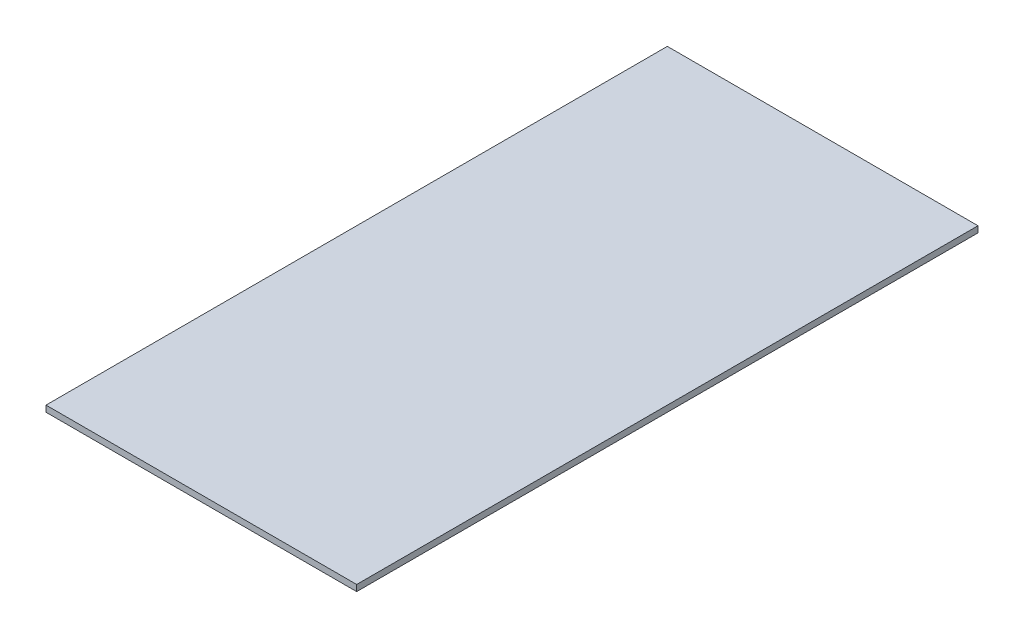
ISO-10303-21;
HEADER;
FILE_DESCRIPTION(('STEP AP214'),'2;1');
FILE_NAME('part.step','',(''),(''),'','','');
FILE_SCHEMA(('AUTOMOTIVE_DESIGN { 1 0 10303 214 1 1 1 1 }'));
ENDSEC;
DATA;
#1=APPLICATION_CONTEXT('core data for automotive mechanical design processes');
#2=APPLICATION_PROTOCOL_DEFINITION('international standard','automotive_design',2000,#1);
#3=PRODUCT_CONTEXT('',#1,'mechanical');
#4=PRODUCT('Part','Part','',(#3));
#5=PRODUCT_RELATED_PRODUCT_CATEGORY('part','',(#4));
#6=PRODUCT_DEFINITION_FORMATION('','',#4);
#7=PRODUCT_DEFINITION_CONTEXT('part definition',#1,'design');
#8=PRODUCT_DEFINITION('design','',#6,#7);
#9=PRODUCT_DEFINITION_SHAPE('','',#8);
#10=(LENGTH_UNIT() NAMED_UNIT(*) SI_UNIT(.MILLI.,.METRE.));
#11=(NAMED_UNIT(*) PLANE_ANGLE_UNIT() SI_UNIT($,.RADIAN.));
#12=(NAMED_UNIT(*) SI_UNIT($,.STERADIAN.) SOLID_ANGLE_UNIT());
#13=UNCERTAINTY_MEASURE_WITH_UNIT(LENGTH_MEASURE(1.E-05),#10,'distance_accuracy_value','');
#14=(GEOMETRIC_REPRESENTATION_CONTEXT(3) GLOBAL_UNCERTAINTY_ASSIGNED_CONTEXT((#13)) GLOBAL_UNIT_ASSIGNED_CONTEXT((#10,
#11,#12)) REPRESENTATION_CONTEXT('',''));
#15=CARTESIAN_POINT('',(0.,0.,0.));
#16=DIRECTION('',(0.,0.,1.));
#17=DIRECTION('',(1.,0.,0.));
#18=AXIS2_PLACEMENT_3D('',#15,#16,#17);
#19=CARTESIAN_POINT('',(100.,4.,150.511260396948));
#20=DIRECTION('',(-1.,0.,0.));
#21=DIRECTION('',(0.,0.,1.));
#22=AXIS2_PLACEMENT_3D('',#19,#20,#21);
#23=PLANE('',#22);
#24=DIRECTION('',(0.,0.,-1.));
#25=VECTOR('',#24,1.);
#26=CARTESIAN_POINT('',(100.,0.,150.511260396948));
#27=LINE('',#26,#25);
#28=CARTESIAN_POINT('',(100.,0.,150.511260396948));
#29=VERTEX_POINT('',#28);
#30=CARTESIAN_POINT('',(100.,0.,-249.488739603052));
#31=VERTEX_POINT('',#30);
#32=EDGE_CURVE('E96',#29,#31,#27,.T.);
#33=ORIENTED_EDGE('',*,*,#32,.T.);
#34=DIRECTION('',(0.,-1.,0.));
#35=VECTOR('',#34,1.);
#36=CARTESIAN_POINT('',(100.,4.,-249.488739603052));
#37=LINE('',#36,#35);
#38=CARTESIAN_POINT('',(100.,4.,-249.488739603052));
#39=VERTEX_POINT('',#38);
#40=EDGE_CURVE('E11',#39,#31,#37,.T.);
#41=ORIENTED_EDGE('',*,*,#40,.F.);
#42=DIRECTION('',(0.,0.,-1.));
#43=VECTOR('',#42,1.);
#44=CARTESIAN_POINT('',(100.,4.,150.511260396948));
#45=LINE('',#44,#43);
#46=CARTESIAN_POINT('',(100.,4.,150.511260396948));
#47=VERTEX_POINT('',#46);
#48=EDGE_CURVE('E84',#47,#39,#45,.T.);
#49=ORIENTED_EDGE('',*,*,#48,.F.);
#50=DIRECTION('',(0.,-1.,0.));
#51=VECTOR('',#50,1.);
#52=CARTESIAN_POINT('',(100.,4.,150.511260396948));
#53=LINE('',#52,#51);
#54=EDGE_CURVE('E92',#47,#29,#53,.T.);
#55=ORIENTED_EDGE('',*,*,#54,.T.);
#56=EDGE_LOOP('',(#33,#41,#49,#55));
#57=FACE_BOUND('',#56,.T.);
#58=ADVANCED_FACE('F33',(#57),#23,.F.);
#59=CARTESIAN_POINT('',(-100.,4.,-249.488739603052));
#60=DIRECTION('',(0.,0.,1.));
#61=DIRECTION('',(1.,0.,0.));
#62=AXIS2_PLACEMENT_3D('',#59,#60,#61);
#63=PLANE('',#62);
#64=DIRECTION('',(-1.,0.,0.));
#65=VECTOR('',#64,1.);
#66=CARTESIAN_POINT('',(-100.,0.,-249.488739603052));
#67=LINE('',#66,#65);
#68=CARTESIAN_POINT('',(-100.,0.,-249.488739603052));
#69=VERTEX_POINT('',#68);
#70=EDGE_CURVE('E88',#31,#69,#67,.T.);
#71=ORIENTED_EDGE('',*,*,#70,.T.);
#72=DIRECTION('',(0.,-1.,0.));
#73=VECTOR('',#72,1.);
#74=CARTESIAN_POINT('',(-100.,4.,-249.488739603052));
#75=LINE('',#74,#73);
#76=CARTESIAN_POINT('',(-100.,4.,-249.488739603052));
#77=VERTEX_POINT('',#76);
#78=EDGE_CURVE('E41',#77,#69,#75,.T.);
#79=ORIENTED_EDGE('',*,*,#78,.F.);
#80=DIRECTION('',(-1.,0.,0.));
#81=VECTOR('',#80,1.);
#82=CARTESIAN_POINT('',(-100.,4.,-249.488739603052));
#83=LINE('',#82,#81);
#84=EDGE_CURVE('E79',#39,#77,#83,.T.);
#85=ORIENTED_EDGE('',*,*,#84,.F.);
#86=ORIENTED_EDGE('',*,*,#40,.T.);
#87=EDGE_LOOP('',(#71,#79,#85,#86));
#88=FACE_BOUND('',#87,.T.);
#89=ADVANCED_FACE('F87',(#88),#63,.F.);
#90=CARTESIAN_POINT('',(-100.,4.,150.511260396948));
#91=DIRECTION('',(1.,0.,0.));
#92=DIRECTION('',(0.,0.,-1.));
#93=AXIS2_PLACEMENT_3D('',#90,#91,#92);
#94=PLANE('',#93);
#95=DIRECTION('',(0.,0.,1.));
#96=VECTOR('',#95,1.);
#97=CARTESIAN_POINT('',(-100.,0.,150.511260396948));
#98=LINE('',#97,#96);
#99=CARTESIAN_POINT('',(-100.,0.,150.511260396948));
#100=VERTEX_POINT('',#99);
#101=EDGE_CURVE('E66',#69,#100,#98,.T.);
#102=ORIENTED_EDGE('',*,*,#101,.T.);
#103=DIRECTION('',(0.,-1.,0.));
#104=VECTOR('',#103,1.);
#105=CARTESIAN_POINT('',(-100.,4.,150.511260396948));
#106=LINE('',#105,#104);
#107=CARTESIAN_POINT('',(-100.,4.,150.511260396948));
#108=VERTEX_POINT('',#107);
#109=EDGE_CURVE('E89',#108,#100,#106,.T.);
#110=ORIENTED_EDGE('',*,*,#109,.F.);
#111=DIRECTION('',(0.,0.,1.));
#112=VECTOR('',#111,1.);
#113=CARTESIAN_POINT('',(-100.,4.,150.511260396948));
#114=LINE('',#113,#112);
#115=EDGE_CURVE('E82',#77,#108,#114,.T.);
#116=ORIENTED_EDGE('',*,*,#115,.F.);
#117=ORIENTED_EDGE('',*,*,#78,.T.);
#118=EDGE_LOOP('',(#102,#110,#116,#117));
#119=FACE_BOUND('',#118,.T.);
#120=ADVANCED_FACE('F90',(#119),#94,.F.);
#121=CARTESIAN_POINT('',(-100.,4.,150.511260396948));
#122=DIRECTION('',(0.,0.,-1.));
#123=DIRECTION('',(-1.,0.,0.));
#124=AXIS2_PLACEMENT_3D('',#121,#122,#123);
#125=PLANE('',#124);
#126=DIRECTION('',(1.,0.,0.));
#127=VECTOR('',#126,1.);
#128=CARTESIAN_POINT('',(-100.,0.,150.511260396948));
#129=LINE('',#128,#127);
#130=EDGE_CURVE('E72',#100,#29,#129,.T.);
#131=ORIENTED_EDGE('',*,*,#130,.T.);
#132=ORIENTED_EDGE('',*,*,#54,.F.);
#133=DIRECTION('',(1.,0.,0.));
#134=VECTOR('',#133,1.);
#135=CARTESIAN_POINT('',(-100.,4.,150.511260396948));
#136=LINE('',#135,#134);
#137=EDGE_CURVE('E49',#108,#47,#136,.T.);
#138=ORIENTED_EDGE('',*,*,#137,.F.);
#139=ORIENTED_EDGE('',*,*,#109,.T.);
#140=EDGE_LOOP('',(#131,#132,#138,#139));
#141=FACE_BOUND('',#140,.T.);
#142=ADVANCED_FACE('F103',(#141),#125,.F.);
#143=CARTESIAN_POINT('',(0.,4.,0.));
#144=DIRECTION('',(0.,-1.,0.));
#145=DIRECTION('',(0.,0.,-1.));
#146=AXIS2_PLACEMENT_3D('',#143,#144,#145);
#147=PLANE('',#146);
#148=ORIENTED_EDGE('',*,*,#48,.T.);
#149=ORIENTED_EDGE('',*,*,#84,.T.);
#150=ORIENTED_EDGE('',*,*,#115,.T.);
#151=ORIENTED_EDGE('',*,*,#137,.T.);
#152=EDGE_LOOP('',(#148,#149,#150,#151));
#153=FACE_BOUND('',#152,.T.);
#154=ADVANCED_FACE('F80',(#153),#147,.F.);
#155=CARTESIAN_POINT('',(0.,0.,0.));
#156=DIRECTION('',(0.,-1.,0.));
#157=DIRECTION('',(0.,0.,-1.));
#158=AXIS2_PLACEMENT_3D('',#155,#156,#157);
#159=PLANE('',#158);
#160=ORIENTED_EDGE('',*,*,#32,.F.);
#161=ORIENTED_EDGE('',*,*,#130,.F.);
#162=ORIENTED_EDGE('',*,*,#101,.F.);
#163=ORIENTED_EDGE('',*,*,#70,.F.);
#164=EDGE_LOOP('',(#160,#161,#162,#163));
#165=FACE_BOUND('',#164,.T.);
#166=ADVANCED_FACE('F106',(#165),#159,.T.);
#167=CLOSED_SHELL('',(#58,#89,#120,#142,#154,#166));
#168=MANIFOLD_SOLID_BREP('B2',#167);
#169=ADVANCED_BREP_SHAPE_REPRESENTATION('',(#18,#168),#14);
#170=SHAPE_DEFINITION_REPRESENTATION(#9,#169);
ENDSEC;
END-ISO-10303-21;
